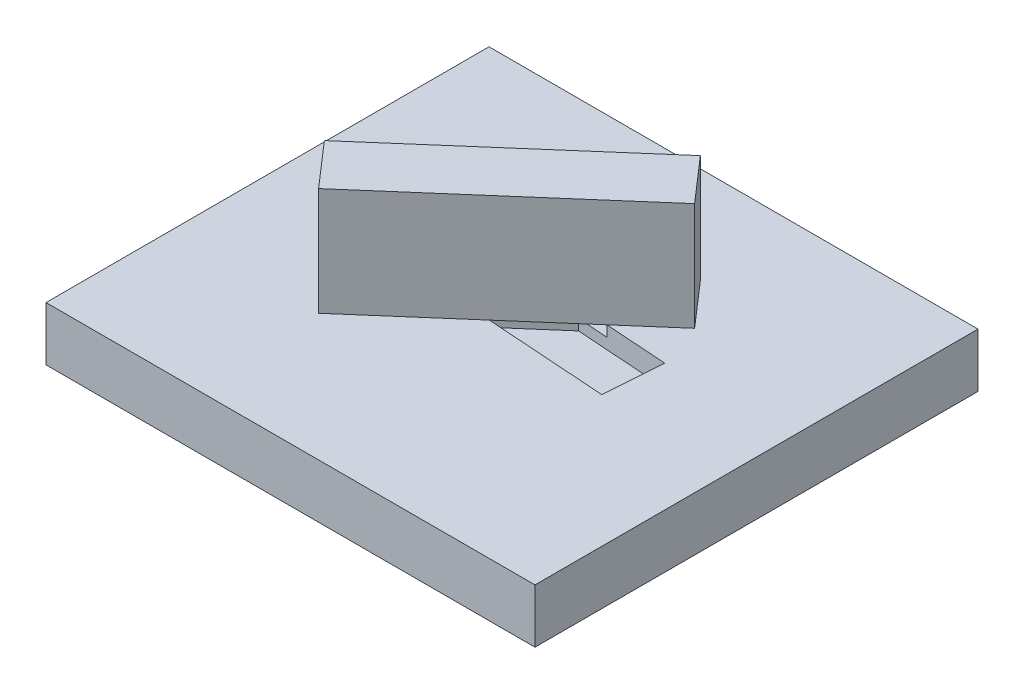
ISO-10303-21;
HEADER;
FILE_DESCRIPTION(('STEP AP214'),'2;1');
FILE_NAME('part.step','',(''),(''),'','','');
FILE_SCHEMA(('AUTOMOTIVE_DESIGN { 1 0 10303 214 1 1 1 1 }'));
ENDSEC;
DATA;
#1=APPLICATION_CONTEXT('core data for automotive mechanical design processes');
#2=APPLICATION_PROTOCOL_DEFINITION('international standard','automotive_design',2000,#1);
#3=PRODUCT_CONTEXT('',#1,'mechanical');
#4=PRODUCT('Part','Part','',(#3));
#5=PRODUCT_RELATED_PRODUCT_CATEGORY('part','',(#4));
#6=PRODUCT_DEFINITION_FORMATION('','',#4);
#7=PRODUCT_DEFINITION_CONTEXT('part definition',#1,'design');
#8=PRODUCT_DEFINITION('design','',#6,#7);
#9=PRODUCT_DEFINITION_SHAPE('','',#8);
#10=(LENGTH_UNIT() NAMED_UNIT(*) SI_UNIT(.MILLI.,.METRE.));
#11=(NAMED_UNIT(*) PLANE_ANGLE_UNIT() SI_UNIT($,.RADIAN.));
#12=(NAMED_UNIT(*) SI_UNIT($,.STERADIAN.) SOLID_ANGLE_UNIT());
#13=UNCERTAINTY_MEASURE_WITH_UNIT(LENGTH_MEASURE(1.E-05),#10,'distance_accuracy_value','');
#14=(GEOMETRIC_REPRESENTATION_CONTEXT(3) GLOBAL_UNCERTAINTY_ASSIGNED_CONTEXT((#13)) GLOBAL_UNIT_ASSIGNED_CONTEXT((#10,
#11,#12)) REPRESENTATION_CONTEXT('',''));
#15=CARTESIAN_POINT('',(0.,0.,0.));
#16=DIRECTION('',(0.,0.,1.));
#17=DIRECTION('',(1.,0.,0.));
#18=AXIS2_PLACEMENT_3D('',#15,#16,#17);
#19=CARTESIAN_POINT('',(-35.3882155607798,15.,-15.8790182203798));
#20=DIRECTION('',(0.754298418020969,0.,-0.656531717871318));
#21=DIRECTION('',(-0.656531717871318,0.,-0.754298418020969));
#22=AXIS2_PLACEMENT_3D('',#19,#20,#21);
#23=PLANE('',#22);
#24=DIRECTION('',(0.656531717871318,0.,0.754298418020969));
#25=VECTOR('',#24,1.);
#26=CARTESIAN_POINT('',(-35.3882155607798,5.,-15.8790182203798));
#27=LINE('',#26,#25);
#28=CARTESIAN_POINT('',(-35.3882155607798,5.,-15.8790182203798));
#29=VERTEX_POINT('',#28);
#30=CARTESIAN_POINT('',(-31.8054733547036,5.,-11.7627558911469));
#31=VERTEX_POINT('',#30);
#32=EDGE_CURVE('E108',#29,#31,#27,.T.);
#33=ORIENTED_EDGE('',*,*,#32,.T.);
#34=DIRECTION('',(0.,-1.,0.));
#35=VECTOR('',#34,1.);
#36=CARTESIAN_POINT('',(-31.8054733547036,15.,-11.7627558911469));
#37=LINE('',#36,#35);
#38=CARTESIAN_POINT('',(-31.8054733547036,15.,-11.7627558911469));
#39=VERTEX_POINT('',#38);
#40=EDGE_CURVE('E12',#39,#31,#37,.T.);
#41=ORIENTED_EDGE('',*,*,#40,.F.);
#42=DIRECTION('',(0.656531717871318,0.,0.754298418020969));
#43=VECTOR('',#42,1.);
#44=CARTESIAN_POINT('',(-35.3882155607798,15.,-15.8790182203798));
#45=LINE('',#44,#43);
#46=CARTESIAN_POINT('',(-35.3882155607798,15.,-15.8790182203798));
#47=VERTEX_POINT('',#46);
#48=EDGE_CURVE('E96',#47,#39,#45,.T.);
#49=ORIENTED_EDGE('',*,*,#48,.F.);
#50=DIRECTION('',(0.,-1.,0.));
#51=VECTOR('',#50,1.);
#52=CARTESIAN_POINT('',(-35.3882155607798,15.,-15.8790182203798));
#53=LINE('',#52,#51);
#54=EDGE_CURVE('E104',#47,#29,#53,.T.);
#55=ORIENTED_EDGE('',*,*,#54,.T.);
#56=EDGE_LOOP('',(#33,#41,#49,#55));
#57=FACE_BOUND('',#56,.T.);
#58=ADVANCED_FACE('F45',(#57),#23,.F.);
#59=CARTESIAN_POINT('',(-31.8054733547036,15.,-11.7627558911469));
#60=DIRECTION('',(-0.656531717871318,0.,-0.754298418020969));
#61=DIRECTION('',(-0.754298418020969,0.,0.656531717871318));
#62=AXIS2_PLACEMENT_3D('',#59,#60,#61);
#63=PLANE('',#62);
#64=DIRECTION('',(0.754298418020969,0.,-0.656531717871318));
#65=VECTOR('',#64,1.);
#66=CARTESIAN_POINT('',(-31.8054733547036,5.,-11.7627558911469));
#67=LINE('',#66,#65);
#68=CARTESIAN_POINT('',(-13.1872813990011,5.,-27.9677925932065));
#69=VERTEX_POINT('',#68);
#70=EDGE_CURVE('E100',#31,#69,#67,.T.);
#71=ORIENTED_EDGE('',*,*,#70,.T.);
#72=DIRECTION('',(0.,-1.,0.));
#73=VECTOR('',#72,1.);
#74=CARTESIAN_POINT('',(-13.1872813990011,15.,-27.9677925932065));
#75=LINE('',#74,#73);
#76=CARTESIAN_POINT('',(-13.1872813990011,15.,-27.9677925932065));
#77=VERTEX_POINT('',#76);
#78=EDGE_CURVE('E53',#77,#69,#75,.T.);
#79=ORIENTED_EDGE('',*,*,#78,.F.);
#80=DIRECTION('',(0.754298418020969,0.,-0.656531717871318));
#81=VECTOR('',#80,1.);
#82=CARTESIAN_POINT('',(-31.8054733547036,15.,-11.7627558911469));
#83=LINE('',#82,#81);
#84=EDGE_CURVE('E91',#39,#77,#83,.T.);
#85=ORIENTED_EDGE('',*,*,#84,.F.);
#86=ORIENTED_EDGE('',*,*,#40,.T.);
#87=EDGE_LOOP('',(#71,#79,#85,#86));
#88=FACE_BOUND('',#87,.T.);
#89=ADVANCED_FACE('F99',(#88),#63,.F.);
#90=CARTESIAN_POINT('',(-16.7700236050774,15.,-32.0840549224393));
#91=DIRECTION('',(-0.754298418020969,0.,0.656531717871318));
#92=DIRECTION('',(0.656531717871318,0.,0.754298418020969));
#93=AXIS2_PLACEMENT_3D('',#90,#91,#92);
#94=PLANE('',#93);
#95=DIRECTION('',(-0.656531717871318,0.,-0.754298418020969));
#96=VECTOR('',#95,1.);
#97=CARTESIAN_POINT('',(-16.7700236050774,5.,-32.0840549224393));
#98=LINE('',#97,#96);
#99=CARTESIAN_POINT('',(-16.7700236050774,5.,-32.0840549224393));
#100=VERTEX_POINT('',#99);
#101=EDGE_CURVE('E78',#69,#100,#98,.T.);
#102=ORIENTED_EDGE('',*,*,#101,.T.);
#103=DIRECTION('',(0.,-1.,0.));
#104=VECTOR('',#103,1.);
#105=CARTESIAN_POINT('',(-16.7700236050774,15.,-32.0840549224393));
#106=LINE('',#105,#104);
#107=CARTESIAN_POINT('',(-16.7700236050774,15.,-32.0840549224393));
#108=VERTEX_POINT('',#107);
#109=EDGE_CURVE('E101',#108,#100,#106,.T.);
#110=ORIENTED_EDGE('',*,*,#109,.F.);
#111=DIRECTION('',(-0.656531717871318,0.,-0.754298418020969));
#112=VECTOR('',#111,1.);
#113=CARTESIAN_POINT('',(-16.7700236050774,15.,-32.0840549224393));
#114=LINE('',#113,#112);
#115=EDGE_CURVE('E94',#77,#108,#114,.T.);
#116=ORIENTED_EDGE('',*,*,#115,.F.);
#117=ORIENTED_EDGE('',*,*,#78,.T.);
#118=EDGE_LOOP('',(#102,#110,#116,#117));
#119=FACE_BOUND('',#118,.T.);
#120=ADVANCED_FACE('F102',(#119),#94,.F.);
#121=CARTESIAN_POINT('',(-35.3882155607798,15.,-15.8790182203798));
#122=DIRECTION('',(0.656531717871318,0.,0.754298418020969));
#123=DIRECTION('',(0.754298418020969,0.,-0.656531717871319));
#124=AXIS2_PLACEMENT_3D('',#121,#122,#123);
#125=PLANE('',#124);
#126=DIRECTION('',(-0.754298418020969,0.,0.656531717871318));
#127=VECTOR('',#126,1.);
#128=CARTESIAN_POINT('',(-35.3882155607798,5.,-15.8790182203798));
#129=LINE('',#128,#127);
#130=EDGE_CURVE('E84',#100,#29,#129,.T.);
#131=ORIENTED_EDGE('',*,*,#130,.T.);
#132=ORIENTED_EDGE('',*,*,#54,.F.);
#133=DIRECTION('',(-0.754298418020969,0.,0.656531717871318));
#134=VECTOR('',#133,1.);
#135=CARTESIAN_POINT('',(-35.3882155607798,15.,-15.8790182203798));
#136=LINE('',#135,#134);
#137=EDGE_CURVE('E61',#108,#47,#136,.T.);
#138=ORIENTED_EDGE('',*,*,#137,.F.);
#139=ORIENTED_EDGE('',*,*,#109,.T.);
#140=EDGE_LOOP('',(#131,#132,#138,#139));
#141=FACE_BOUND('',#140,.T.);
#142=ADVANCED_FACE('F115',(#141),#125,.F.);
#143=CARTESIAN_POINT('',(0.,15.,0.));
#144=DIRECTION('',(0.,1.,0.));
#145=DIRECTION('',(0.,0.,1.));
#146=AXIS2_PLACEMENT_3D('',#143,#144,#145);
#147=PLANE('',#146);
#148=ORIENTED_EDGE('',*,*,#48,.T.);
#149=ORIENTED_EDGE('',*,*,#84,.T.);
#150=ORIENTED_EDGE('',*,*,#115,.T.);
#151=ORIENTED_EDGE('',*,*,#137,.T.);
#152=EDGE_LOOP('',(#148,#149,#150,#151));
#153=FACE_BOUND('',#152,.T.);
#154=ADVANCED_FACE('F92',(#153),#147,.T.);
#155=CARTESIAN_POINT('',(0.,5.,0.));
#156=DIRECTION('',(0.,1.,0.));
#157=DIRECTION('',(0.,0.,1.));
#158=AXIS2_PLACEMENT_3D('',#155,#156,#157);
#159=PLANE('',#158);
#160=ORIENTED_EDGE('',*,*,#32,.F.);
#161=ORIENTED_EDGE('',*,*,#130,.F.);
#162=ORIENTED_EDGE('',*,*,#101,.F.);
#163=ORIENTED_EDGE('',*,*,#70,.F.);
#164=EDGE_LOOP('',(#160,#161,#162,#163));
#165=FACE_BOUND('',#164,.T.);
#166=ADVANCED_FACE('F118',(#165),#159,.F.);
#167=CLOSED_SHELL('',(#58,#89,#120,#142,#154,#166));
#168=MANIFOLD_SOLID_BREP('B2',#167);
#169=CARTESIAN_POINT('',(-11.7872500680421,3.,-23.7922353424912));
#170=DIRECTION('',(0.0691314966500514,0.,-0.997607556191774));
#171=DIRECTION('',(-0.997607556191774,0.,-0.0691314966500514));
#172=AXIS2_PLACEMENT_3D('',#169,#170,#171);
#173=PLANE('',#172);
#174=DIRECTION('',(-0.997607556191774,0.,-0.0691314966500514));
#175=VECTOR('',#174,1.);
#176=CARTESIAN_POINT('',(-11.7872500680421,3.,-23.7922353424912));
#177=LINE('',#176,#175);
#178=CARTESIAN_POINT('',(-22.4049534696172,3.,-24.5280133772319));
#179=VERTEX_POINT('',#178);
#180=CARTESIAN_POINT('',(-36.4109911947553,3.,-25.498593786398));
#181=VERTEX_POINT('',#180);
#182=EDGE_CURVE('E379',#179,#181,#177,.T.);
#183=ORIENTED_EDGE('',*,*,#182,.F.);
#184=DIRECTION('',(0.,1.,0.));
#185=VECTOR('',#184,1.);
#186=CARTESIAN_POINT('',(-22.4049534696172,3.,-24.5280133772319));
#187=LINE('',#186,#185);
#188=CARTESIAN_POINT('',(-22.4049534696172,4.,-24.5280133772319));
#189=VERTEX_POINT('',#188);
#190=EDGE_CURVE('E360',#179,#189,#187,.T.);
#191=ORIENTED_EDGE('',*,*,#190,.T.);
#192=DIRECTION('',(-0.997607556191774,0.,-0.0691314966500514));
#193=VECTOR('',#192,1.);
#194=CARTESIAN_POINT('',(1.58452456426641,4.,-22.8656076445942));
#195=LINE('',#194,#193);
#196=CARTESIAN_POINT('',(-25.2266137414017,4.,-24.7235467775312));
#197=VERTEX_POINT('',#196);
#198=EDGE_CURVE('E492',#189,#197,#195,.T.);
#199=ORIENTED_EDGE('',*,*,#198,.T.);
#200=DIRECTION('',(0.,-1.,0.));
#201=VECTOR('',#200,1.);
#202=CARTESIAN_POINT('',(-25.2266137414017,4.,-24.7235467775312));
#203=LINE('',#202,#201);
#204=CARTESIAN_POINT('',(-25.2266137414017,5.,-24.7235467775312));
#205=VERTEX_POINT('',#204);
#206=EDGE_CURVE('E419',#205,#197,#203,.T.);
#207=ORIENTED_EDGE('',*,*,#206,.F.);
#208=DIRECTION('',(-0.997607556191774,0.,-0.0691314966500514));
#209=VECTOR('',#208,1.);
#210=CARTESIAN_POINT('',(-11.7872500680421,5.,-23.7922353424912));
#211=LINE('',#210,#209);
#212=CARTESIAN_POINT('',(-36.4109911947553,5.,-25.498593786398));
#213=VERTEX_POINT('',#212);
#214=EDGE_CURVE('E374',#205,#213,#211,.T.);
#215=ORIENTED_EDGE('',*,*,#214,.T.);
#216=DIRECTION('',(0.,1.,0.));
#217=VECTOR('',#216,1.);
#218=CARTESIAN_POINT('',(-36.4109911947553,3.,-25.498593786398));
#219=LINE('',#218,#217);
#220=EDGE_CURVE('E389',#181,#213,#219,.T.);
#221=ORIENTED_EDGE('',*,*,#220,.F.);
#222=EDGE_LOOP('',(#183,#191,#199,#207,#215,#221));
#223=FACE_BOUND('',#222,.T.);
#224=ADVANCED_FACE('F169',(#223),#173,.F.);
#225=CARTESIAN_POINT('',(-36.7882468917389,3.,-20.054575471095));
#226=DIRECTION('',(-0.0691314966500515,0.,0.997607556191774));
#227=DIRECTION('',(0.997607556191774,0.,0.0691314966500515));
#228=AXIS2_PLACEMENT_3D('',#225,#226,#227);
#229=PLANE('',#228);
#230=DIRECTION('',(0.997607556191774,0.,0.0691314966500515));
#231=VECTOR('',#230,1.);
#232=CARTESIAN_POINT('',(1.20726886728285,4.,-17.4215893292911));
#233=LINE('',#232,#231);
#234=CARTESIAN_POINT('',(-31.0478877536883,4.,-19.6567841592117));
#235=VERTEX_POINT('',#234);
#236=CARTESIAN_POINT('',(-28.2262274819038,4.,-19.4612507589124));
#237=VERTEX_POINT('',#236);
#238=EDGE_CURVE('E489',#235,#237,#233,.T.);
#239=ORIENTED_EDGE('',*,*,#238,.T.);
#240=DIRECTION('',(0.,-1.,0.));
#241=VECTOR('',#240,1.);
#242=CARTESIAN_POINT('',(-28.2262274819038,3.,-19.4612507589124));
#243=LINE('',#242,#241);
#244=CARTESIAN_POINT('',(-28.2262274819038,3.,-19.4612507589124));
#245=VERTEX_POINT('',#244);
#246=EDGE_CURVE('E357',#237,#245,#243,.T.);
#247=ORIENTED_EDGE('',*,*,#246,.T.);
#248=DIRECTION('',(0.997607556191774,0.,0.0691314966500515));
#249=VECTOR('',#248,1.);
#250=CARTESIAN_POINT('',(-36.7882468917389,3.,-20.054575471095));
#251=LINE('',#250,#249);
#252=CARTESIAN_POINT('',(-36.7882468917389,3.,-20.054575471095));
#253=VERTEX_POINT('',#252);
#254=EDGE_CURVE('E383',#253,#245,#251,.T.);
#255=ORIENTED_EDGE('',*,*,#254,.F.);
#256=DIRECTION('',(0.,1.,0.));
#257=VECTOR('',#256,1.);
#258=CARTESIAN_POINT('',(-36.7882468917389,3.,-20.054575471095));
#259=LINE('',#258,#257);
#260=CARTESIAN_POINT('',(-36.7882468917389,5.,-20.054575471095));
#261=VERTEX_POINT('',#260);
#262=EDGE_CURVE('E407',#253,#261,#259,.T.);
#263=ORIENTED_EDGE('',*,*,#262,.T.);
#264=DIRECTION('',(0.997607556191774,0.,0.0691314966500515));
#265=VECTOR('',#264,1.);
#266=CARTESIAN_POINT('',(-36.7882468917389,5.,-20.054575471095));
#267=LINE('',#266,#265);
#268=CARTESIAN_POINT('',(-31.0478877536883,5.,-19.6567841592117));
#269=VERTEX_POINT('',#268);
#270=EDGE_CURVE('E396',#261,#269,#267,.T.);
#271=ORIENTED_EDGE('',*,*,#270,.T.);
#272=DIRECTION('',(0.,1.,0.));
#273=VECTOR('',#272,1.);
#274=CARTESIAN_POINT('',(-31.0478877536883,4.,-19.6567841592117));
#275=LINE('',#274,#273);
#276=EDGE_CURVE('E413',#235,#269,#275,.T.);
#277=ORIENTED_EDGE('',*,*,#276,.F.);
#278=EDGE_LOOP('',(#239,#247,#255,#263,#271,#277));
#279=FACE_BOUND('',#278,.T.);
#280=ADVANCED_FACE('F506',(#279),#229,.F.);
#281=CARTESIAN_POINT('',(0.,3.,0.));
#282=DIRECTION('',(0.,1.,0.));
#283=DIRECTION('',(0.,0.,1.));
#284=AXIS2_PLACEMENT_3D('',#281,#282,#283);
#285=PLANE('',#284);
#286=DIRECTION('',(-0.754298418020968,0.,0.656531717871318));
#287=VECTOR('',#286,1.);
#288=CARTESIAN_POINT('',(-21.8040776907869,3.,-25.0510079876909));
#289=LINE('',#288,#287);
#290=EDGE_CURVE('E335',#179,#245,#289,.T.);
#291=ORIENTED_EDGE('',*,*,#290,.F.);
#292=ORIENTED_EDGE('',*,*,#182,.T.);
#293=DIRECTION('',(-0.069131496650052,0.,0.997607556191774));
#294=VECTOR('',#293,1.);
#295=CARTESIAN_POINT('',(-36.4109911947553,3.,-25.498593786398));
#296=LINE('',#295,#294);
#297=EDGE_CURVE('E378',#181,#253,#296,.T.);
#298=ORIENTED_EDGE('',*,*,#297,.T.);
#299=ORIENTED_EDGE('',*,*,#254,.T.);
#300=EDGE_LOOP('',(#291,#292,#298,#299));
#301=FACE_BOUND('',#300,.T.);
#302=ADVANCED_FACE('F508',(#301),#285,.T.);
#303=CARTESIAN_POINT('',(-16.7700236050774,4.,-32.0840549224393));
#304=DIRECTION('',(-0.656531717871318,0.,-0.754298418020968));
#305=DIRECTION('',(-0.754298418020969,0.,0.656531717871318));
#306=AXIS2_PLACEMENT_3D('',#303,#304,#305);
#307=PLANE('',#306);
#308=DIRECTION('',(-0.754298418020968,0.,0.656531717871318));
#309=VECTOR('',#308,1.);
#310=CARTESIAN_POINT('',(-16.7700236050774,5.,-32.0840549224393));
#311=LINE('',#310,#309);
#312=CARTESIAN_POINT('',(-16.7700236050774,5.,-32.0840549224393));
#313=VERTEX_POINT('',#312);
#314=EDGE_CURVE('E437',#313,#205,#311,.T.);
#315=ORIENTED_EDGE('',*,*,#314,.T.);
#316=ORIENTED_EDGE('',*,*,#206,.T.);
#317=DIRECTION('',(-0.754298418020968,0.,0.656531717871318));
#318=VECTOR('',#317,1.);
#319=CARTESIAN_POINT('',(-16.7700236050774,4.,-32.0840549224393));
#320=LINE('',#319,#318);
#321=CARTESIAN_POINT('',(-16.7700236050774,4.,-32.0840549224393));
#322=VERTEX_POINT('',#321);
#323=EDGE_CURVE('E423',#322,#197,#320,.T.);
#324=ORIENTED_EDGE('',*,*,#323,.F.);
#325=DIRECTION('',(0.,1.,0.));
#326=VECTOR('',#325,1.);
#327=CARTESIAN_POINT('',(-16.7700236050774,4.,-32.0840549224393));
#328=LINE('',#327,#326);
#329=EDGE_CURVE('E450',#322,#313,#328,.T.);
#330=ORIENTED_EDGE('',*,*,#329,.T.);
#331=EDGE_LOOP('',(#315,#316,#324,#330));
#332=FACE_BOUND('',#331,.T.);
#333=ADVANCED_FACE('F570',(#332),#307,.F.);
#334=CARTESIAN_POINT('',(-31.8054733547036,4.,-11.7627558911469));
#335=DIRECTION('',(0.656531717871318,0.,0.754298418020969));
#336=DIRECTION('',(0.754298418020969,0.,-0.656531717871318));
#337=AXIS2_PLACEMENT_3D('',#334,#335,#336);
#338=PLANE('',#337);
#339=DIRECTION('',(0.754298418020969,0.,-0.656531717871318));
#340=VECTOR('',#339,1.);
#341=CARTESIAN_POINT('',(-31.8054733547036,4.,-11.7627558911469));
#342=LINE('',#341,#340);
#343=CARTESIAN_POINT('',(-17.5276092060927,4.,-24.1900266543745));
#344=VERTEX_POINT('',#343);
#345=CARTESIAN_POINT('',(-13.1872813990011,4.,-27.9677925932065));
#346=VERTEX_POINT('',#345);
#347=EDGE_CURVE('E430',#344,#346,#342,.T.);
#348=ORIENTED_EDGE('',*,*,#347,.F.);
#349=DIRECTION('',(0.,1.,0.));
#350=VECTOR('',#349,1.);
#351=CARTESIAN_POINT('',(-17.5276092060926,4.,-24.1900266543745));
#352=LINE('',#351,#350);
#353=CARTESIAN_POINT('',(-17.5276092060926,5.,-24.1900266543745));
#354=VERTEX_POINT('',#353);
#355=EDGE_CURVE('E416',#344,#354,#352,.T.);
#356=ORIENTED_EDGE('',*,*,#355,.T.);
#357=DIRECTION('',(0.754298418020969,0.,-0.656531717871318));
#358=VECTOR('',#357,1.);
#359=CARTESIAN_POINT('',(-31.8054733547036,5.,-11.7627558911469));
#360=LINE('',#359,#358);
#361=CARTESIAN_POINT('',(-13.1872813990011,5.,-27.9677925932065));
#362=VERTEX_POINT('',#361);
#363=EDGE_CURVE('E443',#354,#362,#360,.T.);
#364=ORIENTED_EDGE('',*,*,#363,.T.);
#365=DIRECTION('',(0.,1.,0.));
#366=VECTOR('',#365,1.);
#367=CARTESIAN_POINT('',(-13.1872813990011,4.,-27.9677925932065));
#368=LINE('',#367,#366);
#369=EDGE_CURVE('E453',#346,#362,#368,.T.);
#370=ORIENTED_EDGE('',*,*,#369,.F.);
#371=EDGE_LOOP('',(#348,#356,#364,#370));
#372=FACE_BOUND('',#371,.T.);
#373=ADVANCED_FACE('F561',(#372),#338,.F.);
#374=CARTESIAN_POINT('',(0.,4.,0.));
#375=DIRECTION('',(0.,1.,0.));
#376=DIRECTION('',(0.,0.,1.));
#377=AXIS2_PLACEMENT_3D('',#374,#375,#376);
#378=PLANE('',#377);
#379=DIRECTION('',(-0.754298418020968,0.,0.656531717871318));
#380=VECTOR('',#379,1.);
#381=CARTESIAN_POINT('',(-21.8040776907869,4.,-25.0510079876909));
#382=LINE('',#381,#380);
#383=CARTESIAN_POINT('',(-16.9655570053767,4.,-29.2623946506548));
#384=VERTEX_POINT('',#383);
#385=EDGE_CURVE('E365',#384,#189,#382,.T.);
#386=ORIENTED_EDGE('',*,*,#385,.F.);
#387=DIRECTION('',(-0.656531717871317,0.,-0.75429841802097));
#388=VECTOR('',#387,1.);
#389=CARTESIAN_POINT('',(4.83852068541016,4.,-4.21138666296384));
#390=LINE('',#389,#388);
#391=CARTESIAN_POINT('',(-16.0089416707857,4.,-28.1633259935058));
#392=VERTEX_POINT('',#391);
#393=EDGE_CURVE('E372',#392,#384,#390,.T.);
#394=ORIENTED_EDGE('',*,*,#393,.F.);
#395=DIRECTION('',(0.754298418020969,0.,-0.656531717871318));
#396=VECTOR('',#395,1.);
#397=CARTESIAN_POINT('',(-20.8474623561959,4.,-23.9519393305419));
#398=LINE('',#397,#396);
#399=CARTESIAN_POINT('',(-20.3492694778772,4.,-24.3855600546738));
#400=VERTEX_POINT('',#399);
#401=EDGE_CURVE('E348',#400,#392,#398,.T.);
#402=ORIENTED_EDGE('',*,*,#401,.F.);
#403=EDGE_CURVE('E493',#344,#400,#195,.T.);
#404=ORIENTED_EDGE('',*,*,#403,.F.);
#405=ORIENTED_EDGE('',*,*,#347,.T.);
#406=DIRECTION('',(-0.656531717871318,0.,-0.754298418020969));
#407=VECTOR('',#406,1.);
#408=CARTESIAN_POINT('',(-13.1872813990011,4.,-27.9677925932065));
#409=LINE('',#408,#407);
#410=EDGE_CURVE('E433',#346,#322,#409,.T.);
#411=ORIENTED_EDGE('',*,*,#410,.T.);
#412=ORIENTED_EDGE('',*,*,#323,.T.);
#413=ORIENTED_EDGE('',*,*,#198,.F.);
#414=EDGE_LOOP('',(#386,#394,#402,#404,#405,#411,#412,#413));
#415=FACE_BOUND('',#414,.T.);
#416=ADVANCED_FACE('F558',(#415),#378,.T.);
#417=CARTESIAN_POINT('',(0.,5.,0.));
#418=DIRECTION('',(-1.,0.,0.));
#419=DIRECTION('',(0.,0.,1.));
#420=AXIS2_PLACEMENT_3D('',#417,#418,#419);
#421=PLANE('',#420);
#422=DIRECTION('',(0.,0.,-1.));
#423=VECTOR('',#422,1.);
#424=CARTESIAN_POINT('',(0.,0.,0.));
#425=LINE('',#424,#423);
#426=CARTESIAN_POINT('',(0.,0.,0.));
#427=VERTEX_POINT('',#426);
#428=CARTESIAN_POINT('',(0.,0.,-41.0270382616911));
#429=VERTEX_POINT('',#428);
#430=EDGE_CURVE('E452',#427,#429,#425,.T.);
#431=ORIENTED_EDGE('',*,*,#430,.T.);
#432=DIRECTION('',(0.,-1.,0.));
#433=VECTOR('',#432,1.);
#434=CARTESIAN_POINT('',(0.,5.,-41.0270382616911));
#435=LINE('',#434,#433);
#436=CARTESIAN_POINT('',(0.,5.,-41.0270382616911));
#437=VERTEX_POINT('',#436);
#438=EDGE_CURVE('E486',#437,#429,#435,.T.);
#439=ORIENTED_EDGE('',*,*,#438,.F.);
#440=DIRECTION('',(0.,0.,-1.));
#441=VECTOR('',#440,1.);
#442=CARTESIAN_POINT('',(0.,5.,0.));
#443=LINE('',#442,#441);
#444=CARTESIAN_POINT('',(0.,5.,0.));
#445=VERTEX_POINT('',#444);
#446=EDGE_CURVE('E460',#445,#437,#443,.T.);
#447=ORIENTED_EDGE('',*,*,#446,.F.);
#448=DIRECTION('',(0.,-1.,0.));
#449=VECTOR('',#448,1.);
#450=CARTESIAN_POINT('',(0.,5.,0.));
#451=LINE('',#450,#449);
#452=EDGE_CURVE('E470',#445,#427,#451,.T.);
#453=ORIENTED_EDGE('',*,*,#452,.T.);
#454=EDGE_LOOP('',(#431,#439,#447,#453));
#455=FACE_BOUND('',#454,.T.);
#456=ADVANCED_FACE('F171',(#455),#421,.F.);
#457=CARTESIAN_POINT('',(0.,5.,-41.0270382616911));
#458=DIRECTION('',(0.,0.,1.));
#459=DIRECTION('',(1.,0.,0.));
#460=AXIS2_PLACEMENT_3D('',#457,#458,#459);
#461=PLANE('',#460);
#462=DIRECTION('',(-1.,0.,0.));
#463=VECTOR('',#462,1.);
#464=CARTESIAN_POINT('',(0.,0.,-41.0270382616911));
#465=LINE('',#464,#463);
#466=CARTESIAN_POINT('',(-45.2866761139978,0.,-41.0270382616911));
#467=VERTEX_POINT('',#466);
#468=EDGE_CURVE('E473',#429,#467,#465,.T.);
#469=ORIENTED_EDGE('',*,*,#468,.T.);
#470=DIRECTION('',(0.,-1.,0.));
#471=VECTOR('',#470,1.);
#472=CARTESIAN_POINT('',(-45.2866761139978,5.,-41.0270382616911));
#473=LINE('',#472,#471);
#474=CARTESIAN_POINT('',(-45.2866761139978,5.,-41.0270382616911));
#475=VERTEX_POINT('',#474);
#476=EDGE_CURVE('E483',#475,#467,#473,.T.);
#477=ORIENTED_EDGE('',*,*,#476,.F.);
#478=DIRECTION('',(-1.,0.,0.));
#479=VECTOR('',#478,1.);
#480=CARTESIAN_POINT('',(0.,5.,-41.0270382616911));
#481=LINE('',#480,#479);
#482=EDGE_CURVE('E463',#437,#475,#481,.T.);
#483=ORIENTED_EDGE('',*,*,#482,.F.);
#484=ORIENTED_EDGE('',*,*,#438,.T.);
#485=EDGE_LOOP('',(#469,#477,#483,#484));
#486=FACE_BOUND('',#485,.T.);
#487=ADVANCED_FACE('F607',(#486),#461,.F.);
#488=CARTESIAN_POINT('',(-45.2866761139978,5.,0.));
#489=DIRECTION('',(1.,0.,0.));
#490=DIRECTION('',(0.,0.,-1.));
#491=AXIS2_PLACEMENT_3D('',#488,#489,#490);
#492=PLANE('',#491);
#493=DIRECTION('',(0.,0.,1.));
#494=VECTOR('',#493,1.);
#495=CARTESIAN_POINT('',(-45.2866761139978,0.,0.));
#496=LINE('',#495,#494);
#497=CARTESIAN_POINT('',(-45.2866761139978,0.,0.));
#498=VERTEX_POINT('',#497);
#499=EDGE_CURVE('E475',#467,#498,#496,.T.);
#500=ORIENTED_EDGE('',*,*,#499,.T.);
#501=DIRECTION('',(0.,-1.,0.));
#502=VECTOR('',#501,1.);
#503=CARTESIAN_POINT('',(-45.2866761139978,5.,0.));
#504=LINE('',#503,#502);
#505=CARTESIAN_POINT('',(-45.2866761139978,5.,0.));
#506=VERTEX_POINT('',#505);
#507=EDGE_CURVE('E480',#506,#498,#504,.T.);
#508=ORIENTED_EDGE('',*,*,#507,.F.);
#509=DIRECTION('',(0.,0.,1.));
#510=VECTOR('',#509,1.);
#511=CARTESIAN_POINT('',(-45.2866761139978,5.,0.));
#512=LINE('',#511,#510);
#513=EDGE_CURVE('E466',#475,#506,#512,.T.);
#514=ORIENTED_EDGE('',*,*,#513,.F.);
#515=ORIENTED_EDGE('',*,*,#476,.T.);
#516=EDGE_LOOP('',(#500,#508,#514,#515));
#517=FACE_BOUND('',#516,.T.);
#518=ADVANCED_FACE('F632',(#517),#492,.F.);
#519=CARTESIAN_POINT('',(0.,5.,0.));
#520=DIRECTION('',(0.,0.,-1.));
#521=DIRECTION('',(-1.,0.,0.));
#522=AXIS2_PLACEMENT_3D('',#519,#520,#521);
#523=PLANE('',#522);
#524=DIRECTION('',(1.,0.,0.));
#525=VECTOR('',#524,1.);
#526=CARTESIAN_POINT('',(0.,0.,0.));
#527=LINE('',#526,#525);
#528=EDGE_CURVE('E464',#498,#427,#527,.T.);
#529=ORIENTED_EDGE('',*,*,#528,.T.);
#530=ORIENTED_EDGE('',*,*,#452,.F.);
#531=DIRECTION('',(1.,0.,0.));
#532=VECTOR('',#531,1.);
#533=CARTESIAN_POINT('',(0.,5.,0.));
#534=LINE('',#533,#532);
#535=EDGE_CURVE('E468',#506,#445,#534,.T.);
#536=ORIENTED_EDGE('',*,*,#535,.F.);
#537=ORIENTED_EDGE('',*,*,#507,.T.);
#538=EDGE_LOOP('',(#529,#530,#536,#537));
#539=FACE_BOUND('',#538,.T.);
#540=ADVANCED_FACE('F628',(#539),#523,.F.);
#541=CARTESIAN_POINT('',(0.,5.,0.));
#542=DIRECTION('',(0.,1.,0.));
#543=DIRECTION('',(0.,0.,1.));
#544=AXIS2_PLACEMENT_3D('',#541,#542,#543);
#545=PLANE('',#544);
#546=CARTESIAN_POINT('',(-11.7872500680421,5.,-23.7922353424912));
#547=VERTEX_POINT('',#546);
#548=EDGE_CURVE('E390',#547,#354,#211,.T.);
#549=ORIENTED_EDGE('',*,*,#548,.F.);
#550=DIRECTION('',(0.0691314966500513,0.,-0.997607556191774));
#551=VECTOR('',#550,1.);
#552=CARTESIAN_POINT('',(-12.1645057650256,5.,-18.3482170271881));
#553=LINE('',#552,#551);
#554=CARTESIAN_POINT('',(-12.1645057650256,5.,-18.3482170271881));
#555=VERTEX_POINT('',#554);
#556=EDGE_CURVE('E398',#555,#547,#553,.T.);
#557=ORIENTED_EDGE('',*,*,#556,.F.);
#558=CARTESIAN_POINT('',(-23.3488832183792,5.,-19.123264036055));
#559=VERTEX_POINT('',#558);
#560=EDGE_CURVE('E395',#559,#555,#267,.T.);
#561=ORIENTED_EDGE('',*,*,#560,.F.);
#562=CARTESIAN_POINT('',(-31.8054733547036,5.,-11.7627558911469));
#563=VERTEX_POINT('',#562);
#564=EDGE_CURVE('E444',#563,#559,#360,.T.);
#565=ORIENTED_EDGE('',*,*,#564,.F.);
#566=DIRECTION('',(0.656531717871318,0.,0.754298418020969));
#567=VECTOR('',#566,1.);
#568=CARTESIAN_POINT('',(-35.3882155607798,5.,-15.8790182203798));
#569=LINE('',#568,#567);
#570=CARTESIAN_POINT('',(-35.3882155607798,5.,-15.8790182203798));
#571=VERTEX_POINT('',#570);
#572=EDGE_CURVE('E440',#571,#563,#569,.T.);
#573=ORIENTED_EDGE('',*,*,#572,.F.);
#574=EDGE_CURVE('E422',#269,#571,#311,.T.);
#575=ORIENTED_EDGE('',*,*,#574,.F.);
#576=ORIENTED_EDGE('',*,*,#270,.F.);
#577=DIRECTION('',(-0.069131496650052,0.,0.997607556191774));
#578=VECTOR('',#577,1.);
#579=CARTESIAN_POINT('',(-36.4109911947553,5.,-25.498593786398));
#580=LINE('',#579,#578);
#581=EDGE_CURVE('E392',#213,#261,#580,.T.);
#582=ORIENTED_EDGE('',*,*,#581,.F.);
#583=ORIENTED_EDGE('',*,*,#214,.F.);
#584=ORIENTED_EDGE('',*,*,#314,.F.);
#585=DIRECTION('',(-0.656531717871318,0.,-0.754298418020969));
#586=VECTOR('',#585,1.);
#587=CARTESIAN_POINT('',(-13.1872813990011,5.,-27.9677925932065));
#588=LINE('',#587,#586);
#589=EDGE_CURVE('E447',#362,#313,#588,.T.);
#590=ORIENTED_EDGE('',*,*,#589,.F.);
#591=ORIENTED_EDGE('',*,*,#363,.F.);
#592=EDGE_LOOP('',(#549,#557,#561,#565,#573,#575,#576,#582,#583,#584,#590,#591));
#593=FACE_BOUND('',#592,.T.);
#594=ORIENTED_EDGE('',*,*,#446,.T.);
#595=ORIENTED_EDGE('',*,*,#482,.T.);
#596=ORIENTED_EDGE('',*,*,#513,.T.);
#597=ORIENTED_EDGE('',*,*,#535,.T.);
#598=EDGE_LOOP('',(#594,#595,#596,#597));
#599=FACE_BOUND('',#598,.T.);
#600=ADVANCED_FACE('F523',(#593,#599),#545,.T.);
#601=CARTESIAN_POINT('',(0.,0.,0.));
#602=DIRECTION('',(0.,1.,0.));
#603=DIRECTION('',(0.,0.,1.));
#604=AXIS2_PLACEMENT_3D('',#601,#602,#603);
#605=PLANE('',#604);
#606=DIRECTION('',(-0.656531717871317,0.,-0.75429841802097));
#607=VECTOR('',#606,1.);
#608=CARTESIAN_POINT('',(4.83852068541016,0.,-4.21138666296384));
#609=LINE('',#608,#607);
#610=CARTESIAN_POINT('',(-16.0089416707857,0.,-28.1633259935058));
#611=VERTEX_POINT('',#610);
#612=CARTESIAN_POINT('',(-16.9655570053767,0.,-29.2623946506548));
#613=VERTEX_POINT('',#612);
#614=EDGE_CURVE('E43',#611,#613,#609,.T.);
#615=ORIENTED_EDGE('',*,*,#614,.T.);
#616=DIRECTION('',(-0.754298418020968,0.,0.656531717871318));
#617=VECTOR('',#616,1.);
#618=CARTESIAN_POINT('',(-21.8040776907869,0.,-25.0510079876909));
#619=LINE('',#618,#617);
#620=CARTESIAN_POINT('',(-32.5665552889952,0.,-15.6834848200805));
#621=VERTEX_POINT('',#620);
#622=EDGE_CURVE('E367',#613,#621,#619,.T.);
#623=ORIENTED_EDGE('',*,*,#622,.T.);
#624=DIRECTION('',(0.656531717871316,0.,0.754298418020971));
#625=VECTOR('',#624,1.);
#626=CARTESIAN_POINT('',(-10.7624775982085,0.,9.36752316761047));
#627=LINE('',#626,#625);
#628=CARTESIAN_POINT('',(-31.6099399544043,0.,-14.5844161629315));
#629=VERTEX_POINT('',#628);
#630=EDGE_CURVE('E370',#621,#629,#627,.T.);
#631=ORIENTED_EDGE('',*,*,#630,.T.);
#632=DIRECTION('',(0.754298418020969,0.,-0.656531717871318));
#633=VECTOR('',#632,1.);
#634=CARTESIAN_POINT('',(-20.8474623561959,0.,-23.9519393305419));
#635=LINE('',#634,#633);
#636=EDGE_CURVE('E340',#629,#611,#635,.T.);
#637=ORIENTED_EDGE('',*,*,#636,.T.);
#638=EDGE_LOOP('',(#615,#623,#631,#637));
#639=FACE_BOUND('',#638,.T.);
#640=ORIENTED_EDGE('',*,*,#430,.F.);
#641=ORIENTED_EDGE('',*,*,#528,.F.);
#642=ORIENTED_EDGE('',*,*,#499,.F.);
#643=ORIENTED_EDGE('',*,*,#468,.F.);
#644=EDGE_LOOP('',(#640,#641,#642,#643));
#645=FACE_BOUND('',#644,.T.);
#646=ADVANCED_FACE('F534',(#639,#645),#605,.F.);
#647=CARTESIAN_POINT('',(-35.3882155607798,4.,-15.8790182203798));
#648=VERTEX_POINT('',#647);
#649=EDGE_CURVE('E427',#235,#648,#320,.T.);
#650=ORIENTED_EDGE('',*,*,#649,.F.);
#651=ORIENTED_EDGE('',*,*,#276,.T.);
#652=ORIENTED_EDGE('',*,*,#574,.T.);
#653=DIRECTION('',(0.,1.,0.));
#654=VECTOR('',#653,1.);
#655=CARTESIAN_POINT('',(-35.3882155607798,4.,-15.8790182203798));
#656=LINE('',#655,#654);
#657=EDGE_CURVE('E436',#648,#571,#656,.T.);
#658=ORIENTED_EDGE('',*,*,#657,.F.);
#659=EDGE_LOOP('',(#650,#651,#652,#658));
#660=FACE_BOUND('',#659,.T.);
#661=ADVANCED_FACE('F519',(#660),#307,.F.);
#662=CARTESIAN_POINT('',(-13.1872813990011,4.,-27.9677925932065));
#663=DIRECTION('',(0.754298418020969,0.,-0.656531717871318));
#664=DIRECTION('',(-0.656531717871318,0.,-0.754298418020969));
#665=AXIS2_PLACEMENT_3D('',#662,#663,#664);
#666=PLANE('',#665);
#667=ORIENTED_EDGE('',*,*,#589,.T.);
#668=ORIENTED_EDGE('',*,*,#329,.F.);
#669=ORIENTED_EDGE('',*,*,#410,.F.);
#670=ORIENTED_EDGE('',*,*,#369,.T.);
#671=EDGE_LOOP('',(#667,#668,#669,#670));
#672=FACE_BOUND('',#671,.T.);
#673=ADVANCED_FACE('F566',(#672),#666,.F.);
#674=ORIENTED_EDGE('',*,*,#564,.T.);
#675=DIRECTION('',(0.,-1.,0.));
#676=VECTOR('',#675,1.);
#677=CARTESIAN_POINT('',(-23.3488832183792,4.,-19.123264036055));
#678=LINE('',#677,#676);
#679=CARTESIAN_POINT('',(-23.3488832183792,4.,-19.123264036055));
#680=VERTEX_POINT('',#679);
#681=EDGE_CURVE('E403',#559,#680,#678,.T.);
#682=ORIENTED_EDGE('',*,*,#681,.T.);
#683=CARTESIAN_POINT('',(-31.8054733547036,4.,-11.7627558911469));
#684=VERTEX_POINT('',#683);
#685=EDGE_CURVE('E431',#684,#680,#342,.T.);
#686=ORIENTED_EDGE('',*,*,#685,.F.);
#687=DIRECTION('',(0.,1.,0.));
#688=VECTOR('',#687,1.);
#689=CARTESIAN_POINT('',(-31.8054733547036,4.,-11.7627558911469));
#690=LINE('',#689,#688);
#691=EDGE_CURVE('E456',#684,#563,#690,.T.);
#692=ORIENTED_EDGE('',*,*,#691,.T.);
#693=EDGE_LOOP('',(#674,#682,#686,#692));
#694=FACE_BOUND('',#693,.T.);
#695=ADVANCED_FACE('F599',(#694),#338,.F.);
#696=CARTESIAN_POINT('',(-35.3882155607798,4.,-15.8790182203798));
#697=DIRECTION('',(-0.754298418020969,0.,0.656531717871318));
#698=DIRECTION('',(0.656531717871318,0.,0.754298418020969));
#699=AXIS2_PLACEMENT_3D('',#696,#697,#698);
#700=PLANE('',#699);
#701=ORIENTED_EDGE('',*,*,#572,.T.);
#702=ORIENTED_EDGE('',*,*,#691,.F.);
#703=DIRECTION('',(0.656531717871318,0.,0.754298418020969));
#704=VECTOR('',#703,1.);
#705=CARTESIAN_POINT('',(-35.3882155607798,4.,-15.8790182203798));
#706=LINE('',#705,#704);
#707=EDGE_CURVE('E426',#648,#684,#706,.T.);
#708=ORIENTED_EDGE('',*,*,#707,.F.);
#709=ORIENTED_EDGE('',*,*,#657,.T.);
#710=EDGE_LOOP('',(#701,#702,#708,#709));
#711=FACE_BOUND('',#710,.T.);
#712=ADVANCED_FACE('F528',(#711),#700,.F.);
#713=DIRECTION('',(-0.754298418020968,0.,0.656531717871318));
#714=VECTOR('',#713,1.);
#715=CARTESIAN_POINT('',(-21.8040776907869,4.,-25.0510079876909));
#716=LINE('',#715,#714);
#717=CARTESIAN_POINT('',(-32.5665552889952,4.,-15.6834848200805));
#718=VERTEX_POINT('',#717);
#719=EDGE_CURVE('E363',#237,#718,#716,.T.);
#720=ORIENTED_EDGE('',*,*,#719,.F.);
#721=ORIENTED_EDGE('',*,*,#238,.F.);
#722=ORIENTED_EDGE('',*,*,#649,.T.);
#723=ORIENTED_EDGE('',*,*,#707,.T.);
#724=ORIENTED_EDGE('',*,*,#685,.T.);
#725=CARTESIAN_POINT('',(-26.1705434901638,4.,-19.3187974363543));
#726=VERTEX_POINT('',#725);
#727=EDGE_CURVE('E347',#726,#680,#233,.T.);
#728=ORIENTED_EDGE('',*,*,#727,.F.);
#729=DIRECTION('',(0.754298418020969,0.,-0.656531717871318));
#730=VECTOR('',#729,1.);
#731=CARTESIAN_POINT('',(-20.8474623561959,4.,-23.9519393305419));
#732=LINE('',#731,#730);
#733=CARTESIAN_POINT('',(-31.6099399544043,4.,-14.5844161629315));
#734=VERTEX_POINT('',#733);
#735=EDGE_CURVE('E337',#734,#726,#732,.T.);
#736=ORIENTED_EDGE('',*,*,#735,.F.);
#737=DIRECTION('',(0.656531717871316,0.,0.754298418020971));
#738=VECTOR('',#737,1.);
#739=CARTESIAN_POINT('',(-10.7624775982085,4.,9.36752316761047));
#740=LINE('',#739,#738);
#741=EDGE_CURVE('E177',#718,#734,#740,.T.);
#742=ORIENTED_EDGE('',*,*,#741,.F.);
#743=EDGE_LOOP('',(#720,#721,#722,#723,#724,#728,#736,#742));
#744=FACE_BOUND('',#743,.T.);
#745=ADVANCED_FACE('F345',(#744),#378,.T.);
#746=ORIENTED_EDGE('',*,*,#403,.T.);
#747=DIRECTION('',(0.,-1.,0.));
#748=VECTOR('',#747,1.);
#749=CARTESIAN_POINT('',(-20.3492694778772,3.,-24.3855600546738));
#750=LINE('',#749,#748);
#751=CARTESIAN_POINT('',(-20.3492694778772,3.,-24.3855600546738));
#752=VERTEX_POINT('',#751);
#753=EDGE_CURVE('E349',#400,#752,#750,.T.);
#754=ORIENTED_EDGE('',*,*,#753,.T.);
#755=CARTESIAN_POINT('',(-11.7872500680421,3.,-23.7922353424912));
#756=VERTEX_POINT('',#755);
#757=EDGE_CURVE('E375',#756,#752,#177,.T.);
#758=ORIENTED_EDGE('',*,*,#757,.F.);
#759=DIRECTION('',(0.,1.,0.));
#760=VECTOR('',#759,1.);
#761=CARTESIAN_POINT('',(-11.7872500680421,3.,-23.7922353424912));
#762=LINE('',#761,#760);
#763=EDGE_CURVE('E401',#756,#547,#762,.T.);
#764=ORIENTED_EDGE('',*,*,#763,.T.);
#765=ORIENTED_EDGE('',*,*,#548,.T.);
#766=ORIENTED_EDGE('',*,*,#355,.F.);
#767=EDGE_LOOP('',(#746,#754,#758,#764,#765,#766));
#768=FACE_BOUND('',#767,.T.);
#769=ADVANCED_FACE('F553',(#768),#173,.F.);
#770=CARTESIAN_POINT('',(-26.1705434901638,3.,-19.3187974363543));
#771=VERTEX_POINT('',#770);
#772=CARTESIAN_POINT('',(-12.1645057650256,3.,-18.3482170271881));
#773=VERTEX_POINT('',#772);
#774=EDGE_CURVE('E382',#771,#773,#251,.T.);
#775=ORIENTED_EDGE('',*,*,#774,.F.);
#776=DIRECTION('',(0.,1.,0.));
#777=VECTOR('',#776,1.);
#778=CARTESIAN_POINT('',(-26.1705434901638,3.,-19.3187974363543));
#779=LINE('',#778,#777);
#780=EDGE_CURVE('E192',#771,#726,#779,.T.);
#781=ORIENTED_EDGE('',*,*,#780,.T.);
#782=ORIENTED_EDGE('',*,*,#727,.T.);
#783=ORIENTED_EDGE('',*,*,#681,.F.);
#784=ORIENTED_EDGE('',*,*,#560,.T.);
#785=DIRECTION('',(0.,1.,0.));
#786=VECTOR('',#785,1.);
#787=CARTESIAN_POINT('',(-12.1645057650256,3.,-18.3482170271881));
#788=LINE('',#787,#786);
#789=EDGE_CURVE('E404',#773,#555,#788,.T.);
#790=ORIENTED_EDGE('',*,*,#789,.F.);
#791=EDGE_LOOP('',(#775,#781,#782,#783,#784,#790));
#792=FACE_BOUND('',#791,.T.);
#793=ADVANCED_FACE('F546',(#792),#229,.F.);
#794=CARTESIAN_POINT('',(-12.1645057650256,3.,-18.3482170271881));
#795=DIRECTION('',(0.997607556191774,0.,0.0691314966500513));
#796=DIRECTION('',(0.0691314966500513,0.,-0.997607556191774));
#797=AXIS2_PLACEMENT_3D('',#794,#795,#796);
#798=PLANE('',#797);
#799=ORIENTED_EDGE('',*,*,#556,.T.);
#800=ORIENTED_EDGE('',*,*,#763,.F.);
#801=DIRECTION('',(0.0691314966500513,0.,-0.997607556191774));
#802=VECTOR('',#801,1.);
#803=CARTESIAN_POINT('',(-12.1645057650256,3.,-18.3482170271881));
#804=LINE('',#803,#802);
#805=EDGE_CURVE('E386',#773,#756,#804,.T.);
#806=ORIENTED_EDGE('',*,*,#805,.F.);
#807=ORIENTED_EDGE('',*,*,#789,.T.);
#808=EDGE_LOOP('',(#799,#800,#806,#807));
#809=FACE_BOUND('',#808,.T.);
#810=ADVANCED_FACE('F576',(#809),#798,.F.);
#811=CARTESIAN_POINT('',(-36.4109911947553,3.,-25.498593786398));
#812=DIRECTION('',(-0.997607556191774,0.,-0.069131496650052));
#813=DIRECTION('',(-0.069131496650052,0.,0.997607556191774));
#814=AXIS2_PLACEMENT_3D('',#811,#812,#813);
#815=PLANE('',#814);
#816=ORIENTED_EDGE('',*,*,#581,.T.);
#817=ORIENTED_EDGE('',*,*,#262,.F.);
#818=ORIENTED_EDGE('',*,*,#297,.F.);
#819=ORIENTED_EDGE('',*,*,#220,.T.);
#820=EDGE_LOOP('',(#816,#817,#818,#819));
#821=FACE_BOUND('',#820,.T.);
#822=ADVANCED_FACE('F512',(#821),#815,.F.);
#823=DIRECTION('',(0.754298418020969,0.,-0.656531717871318));
#824=VECTOR('',#823,1.);
#825=CARTESIAN_POINT('',(-20.8474623561959,3.,-23.9519393305419));
#826=LINE('',#825,#824);
#827=EDGE_CURVE('E496',#771,#752,#826,.T.);
#828=ORIENTED_EDGE('',*,*,#827,.F.);
#829=ORIENTED_EDGE('',*,*,#774,.T.);
#830=ORIENTED_EDGE('',*,*,#805,.T.);
#831=ORIENTED_EDGE('',*,*,#757,.T.);
#832=EDGE_LOOP('',(#828,#829,#830,#831));
#833=FACE_BOUND('',#832,.T.);
#834=ADVANCED_FACE('F550',(#833),#285,.T.);
#835=CARTESIAN_POINT('',(-16.0089416707857,-2.,-28.1633259935058));
#836=DIRECTION('',(0.75429841802097,0.,-0.656531717871317));
#837=DIRECTION('',(-0.656531717871317,0.,-0.75429841802097));
#838=AXIS2_PLACEMENT_3D('',#835,#836,#837);
#839=PLANE('',#838);
#840=ORIENTED_EDGE('',*,*,#393,.T.);
#841=DIRECTION('',(0.,1.,0.));
#842=VECTOR('',#841,1.);
#843=CARTESIAN_POINT('',(-16.9655570053767,-2.,-29.2623946506548));
#844=LINE('',#843,#842);
#845=EDGE_CURVE('E540',#613,#384,#844,.T.);
#846=ORIENTED_EDGE('',*,*,#845,.F.);
#847=ORIENTED_EDGE('',*,*,#614,.F.);
#848=DIRECTION('',(0.,1.,0.));
#849=VECTOR('',#848,1.);
#850=CARTESIAN_POINT('',(-16.0089416707857,-2.,-28.1633259935058));
#851=LINE('',#850,#849);
#852=EDGE_CURVE('E342',#611,#392,#851,.T.);
#853=ORIENTED_EDGE('',*,*,#852,.T.);
#854=EDGE_LOOP('',(#840,#846,#847,#853));
#855=FACE_BOUND('',#854,.T.);
#856=ADVANCED_FACE('F538',(#855),#839,.F.);
#857=CARTESIAN_POINT('',(-32.5665552889952,-2.,-15.6834848200805));
#858=DIRECTION('',(-0.754298418020971,0.,0.656531717871316));
#859=DIRECTION('',(0.656531717871316,0.,0.754298418020971));
#860=AXIS2_PLACEMENT_3D('',#857,#858,#859);
#861=PLANE('',#860);
#862=DIRECTION('',(0.,1.,0.));
#863=VECTOR('',#862,1.);
#864=CARTESIAN_POINT('',(-32.5665552889952,-2.,-15.6834848200805));
#865=LINE('',#864,#863);
#866=EDGE_CURVE('E331',#621,#718,#865,.T.);
#867=ORIENTED_EDGE('',*,*,#866,.T.);
#868=ORIENTED_EDGE('',*,*,#741,.T.);
#869=DIRECTION('',(0.,1.,0.));
#870=VECTOR('',#869,1.);
#871=CARTESIAN_POINT('',(-31.6099399544043,-2.,-14.5844161629315));
#872=LINE('',#871,#870);
#873=EDGE_CURVE('E184',#629,#734,#872,.T.);
#874=ORIENTED_EDGE('',*,*,#873,.F.);
#875=ORIENTED_EDGE('',*,*,#630,.F.);
#876=EDGE_LOOP('',(#867,#868,#874,#875));
#877=FACE_BOUND('',#876,.T.);
#878=ADVANCED_FACE('F329',(#877),#861,.F.);
#879=CARTESIAN_POINT('',(-16.9655570053767,-2.,-29.2623946506548));
#880=DIRECTION('',(-0.656531717871318,0.,-0.754298418020968));
#881=DIRECTION('',(-0.754298418020968,0.,0.656531717871318));
#882=AXIS2_PLACEMENT_3D('',#879,#880,#881);
#883=PLANE('',#882);
#884=ORIENTED_EDGE('',*,*,#845,.T.);
#885=ORIENTED_EDGE('',*,*,#385,.T.);
#886=ORIENTED_EDGE('',*,*,#190,.F.);
#887=ORIENTED_EDGE('',*,*,#290,.T.);
#888=ORIENTED_EDGE('',*,*,#246,.F.);
#889=ORIENTED_EDGE('',*,*,#719,.T.);
#890=ORIENTED_EDGE('',*,*,#866,.F.);
#891=ORIENTED_EDGE('',*,*,#622,.F.);
#892=EDGE_LOOP('',(#884,#885,#886,#887,#888,#889,#890,#891));
#893=FACE_BOUND('',#892,.T.);
#894=ADVANCED_FACE('F501',(#893),#883,.F.);
#895=CARTESIAN_POINT('',(-31.6099399544043,-2.,-14.5844161629315));
#896=DIRECTION('',(0.656531717871318,0.,0.754298418020969));
#897=DIRECTION('',(0.754298418020969,0.,-0.656531717871318));
#898=AXIS2_PLACEMENT_3D('',#895,#896,#897);
#899=PLANE('',#898);
#900=ORIENTED_EDGE('',*,*,#873,.T.);
#901=ORIENTED_EDGE('',*,*,#735,.T.);
#902=ORIENTED_EDGE('',*,*,#780,.F.);
#903=ORIENTED_EDGE('',*,*,#827,.T.);
#904=ORIENTED_EDGE('',*,*,#753,.F.);
#905=ORIENTED_EDGE('',*,*,#401,.T.);
#906=ORIENTED_EDGE('',*,*,#852,.F.);
#907=ORIENTED_EDGE('',*,*,#636,.F.);
#908=EDGE_LOOP('',(#900,#901,#902,#903,#904,#905,#906,#907));
#909=FACE_BOUND('',#908,.T.);
#910=ADVANCED_FACE('F336',(#909),#899,.F.);
#911=CLOSED_SHELL('',(#224,#280,#302,#333,#373,#416,#456,#487,#518,#540,#600,#646,#661,#673,
#695,#712,#745,#769,#793,#810,#822,#834,#856,#878,#894,#910));
#912=MANIFOLD_SOLID_BREP('B6',#911);
#913=ADVANCED_BREP_SHAPE_REPRESENTATION('',(#18,#168,#912),#14);
#914=SHAPE_DEFINITION_REPRESENTATION(#9,#913);
ENDSEC;
END-ISO-10303-21;
